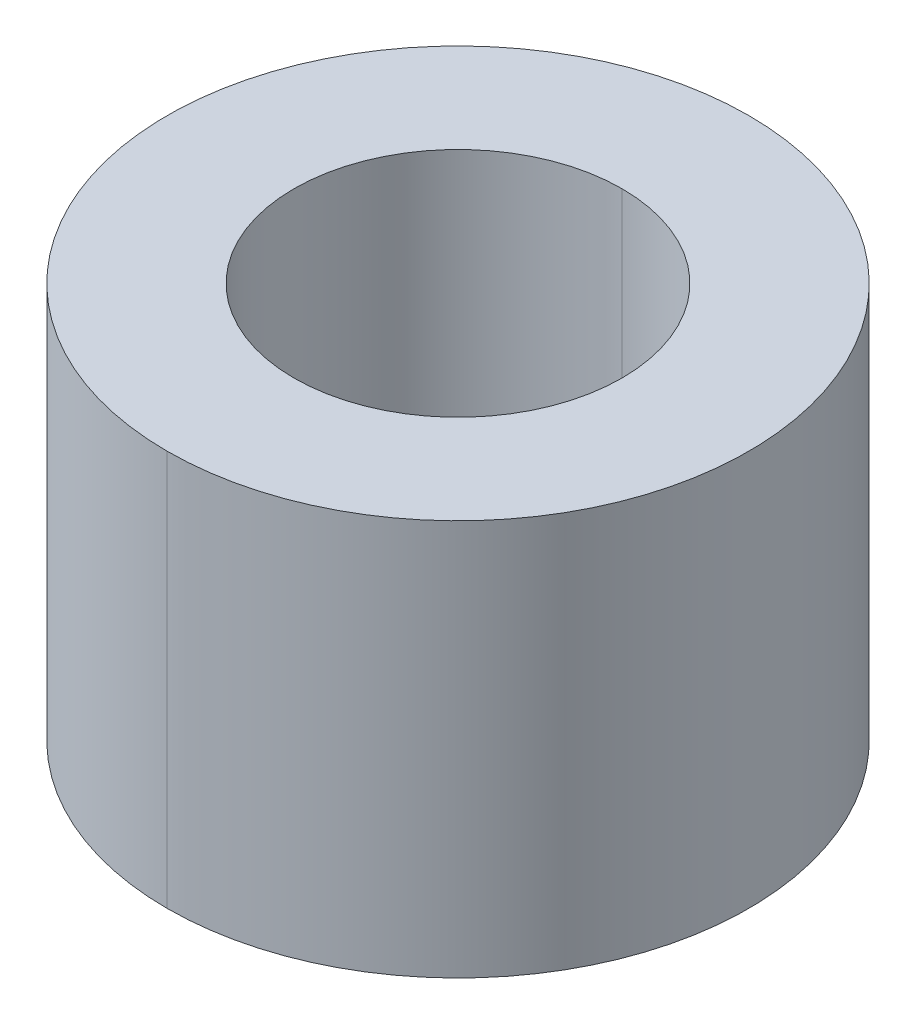
ISO-10303-21;
HEADER;
FILE_DESCRIPTION(('STEP AP214'),'2;1');
FILE_NAME('part.step','',(''),(''),'','','');
FILE_SCHEMA(('AUTOMOTIVE_DESIGN { 1 0 10303 214 1 1 1 1 }'));
ENDSEC;
DATA;
#1=APPLICATION_CONTEXT('core data for automotive mechanical design processes');
#2=APPLICATION_PROTOCOL_DEFINITION('international standard','automotive_design',2000,#1);
#3=PRODUCT_CONTEXT('',#1,'mechanical');
#4=PRODUCT('Part','Part','',(#3));
#5=PRODUCT_RELATED_PRODUCT_CATEGORY('part','',(#4));
#6=PRODUCT_DEFINITION_FORMATION('','',#4);
#7=PRODUCT_DEFINITION_CONTEXT('part definition',#1,'design');
#8=PRODUCT_DEFINITION('design','',#6,#7);
#9=PRODUCT_DEFINITION_SHAPE('','',#8);
#10=(LENGTH_UNIT() NAMED_UNIT(*) SI_UNIT(.MILLI.,.METRE.));
#11=(NAMED_UNIT(*) PLANE_ANGLE_UNIT() SI_UNIT($,.RADIAN.));
#12=(NAMED_UNIT(*) SI_UNIT($,.STERADIAN.) SOLID_ANGLE_UNIT());
#13=UNCERTAINTY_MEASURE_WITH_UNIT(LENGTH_MEASURE(1.E-05),#10,'distance_accuracy_value','');
#14=(GEOMETRIC_REPRESENTATION_CONTEXT(3) GLOBAL_UNCERTAINTY_ASSIGNED_CONTEXT((#13)) GLOBAL_UNIT_ASSIGNED_CONTEXT((#10,
#11,#12)) REPRESENTATION_CONTEXT('',''));
#15=CARTESIAN_POINT('',(0.,0.,0.));
#16=DIRECTION('',(0.,0.,1.));
#17=DIRECTION('',(1.,0.,0.));
#18=AXIS2_PLACEMENT_3D('',#15,#16,#17);
#19=CARTESIAN_POINT('',(0.,30.3,4.44089209850063E-13));
#20=DIRECTION('',(0.,-1.,0.));
#21=DIRECTION('',(0.,0.,-1.));
#22=AXIS2_PLACEMENT_3D('',#19,#20,#21);
#23=CYLINDRICAL_SURFACE('',#22,12.5500000000003);
#24=DIRECTION('',(0.,-1.,0.));
#25=VECTOR('',#24,1.);
#26=CARTESIAN_POINT('',(0.,30.3,12.5500000000008));
#27=LINE('',#26,#25);
#28=CARTESIAN_POINT('',(0.,30.3,12.5500000000004));
#29=VERTEX_POINT('',#28);
#30=CARTESIAN_POINT('',(0.,0.,12.55));
#31=VERTEX_POINT('',#30);
#32=EDGE_CURVE('E91',#29,#31,#27,.T.);
#33=ORIENTED_EDGE('',*,*,#32,.F.);
#34=CARTESIAN_POINT('',(0.,30.3,4.44089209850063E-13));
#35=DIRECTION('',(0.,1.,0.));
#36=DIRECTION('',(0.,0.,1.));
#37=AXIS2_PLACEMENT_3D('',#34,#35,#36);
#38=CIRCLE('',#37,12.5500000000003);
#39=CARTESIAN_POINT('',(0.,30.3,-12.5499999999995));
#40=VERTEX_POINT('',#39);
#41=EDGE_CURVE('E82',#29,#40,#38,.T.);
#42=ORIENTED_EDGE('',*,*,#41,.T.);
#43=DIRECTION('',(0.,-1.,0.));
#44=VECTOR('',#43,1.);
#45=CARTESIAN_POINT('',(0.,30.3,-12.5499999999999));
#46=LINE('',#45,#44);
#47=CARTESIAN_POINT('',(0.,0.,-12.55));
#48=VERTEX_POINT('',#47);
#49=EDGE_CURVE('E88',#40,#48,#46,.T.);
#50=ORIENTED_EDGE('',*,*,#49,.T.);
#51=CARTESIAN_POINT('',(0.,0.,0.));
#52=DIRECTION('',(0.,1.,0.));
#53=DIRECTION('',(0.,0.,1.));
#54=AXIS2_PLACEMENT_3D('',#51,#52,#53);
#55=CIRCLE('',#54,12.5500000000003);
#56=EDGE_CURVE('E11',#31,#48,#55,.T.);
#57=ORIENTED_EDGE('',*,*,#56,.F.);
#58=EDGE_LOOP('',(#33,#42,#50,#57));
#59=FACE_BOUND('',#58,.T.);
#60=ADVANCED_FACE('F17',(#59),#23,.F.);
#61=CARTESIAN_POINT('',(0.,30.3,4.44089209850063E-13));
#62=DIRECTION('',(0.,-1.,0.));
#63=DIRECTION('',(0.,0.,-1.));
#64=AXIS2_PLACEMENT_3D('',#61,#62,#63);
#65=CYLINDRICAL_SURFACE('',#64,22.2500000000006);
#66=DIRECTION('',(0.,-1.,0.));
#67=VECTOR('',#66,1.);
#68=CARTESIAN_POINT('',(0.,30.3,22.250000000001));
#69=LINE('',#68,#67);
#70=CARTESIAN_POINT('',(0.,30.3,22.2500000000005));
#71=VERTEX_POINT('',#70);
#72=CARTESIAN_POINT('',(0.,0.,22.25));
#73=VERTEX_POINT('',#72);
#74=EDGE_CURVE('E115',#71,#73,#69,.T.);
#75=ORIENTED_EDGE('',*,*,#74,.F.);
#76=CARTESIAN_POINT('',(0.,30.3,4.44089209850063E-13));
#77=DIRECTION('',(0.,1.,0.));
#78=DIRECTION('',(0.,0.,1.));
#79=AXIS2_PLACEMENT_3D('',#76,#77,#78);
#80=CIRCLE('',#79,22.2500000000006);
#81=CARTESIAN_POINT('',(0.,30.3,-22.2499999999996));
#82=VERTEX_POINT('',#81);
#83=EDGE_CURVE('E21',#82,#71,#80,.T.);
#84=ORIENTED_EDGE('',*,*,#83,.F.);
#85=DIRECTION('',(0.,-1.,0.));
#86=VECTOR('',#85,1.);
#87=CARTESIAN_POINT('',(0.,30.3,-22.25));
#88=LINE('',#87,#86);
#89=CARTESIAN_POINT('',(0.,0.,-22.25));
#90=VERTEX_POINT('',#89);
#91=EDGE_CURVE('E114',#82,#90,#88,.T.);
#92=ORIENTED_EDGE('',*,*,#91,.T.);
#93=CARTESIAN_POINT('',(0.,0.,0.));
#94=DIRECTION('',(0.,1.,0.));
#95=DIRECTION('',(0.,0.,1.));
#96=AXIS2_PLACEMENT_3D('',#93,#94,#95);
#97=CIRCLE('',#96,22.2500000000006);
#98=EDGE_CURVE('E27',#90,#73,#97,.T.);
#99=ORIENTED_EDGE('',*,*,#98,.T.);
#100=EDGE_LOOP('',(#75,#84,#92,#99));
#101=FACE_BOUND('',#100,.T.);
#102=ADVANCED_FACE('F129',(#101),#65,.T.);
#103=CARTESIAN_POINT('',(0.,0.,0.));
#104=DIRECTION('',(0.,1.,0.));
#105=DIRECTION('',(0.,0.,-1.));
#106=AXIS2_PLACEMENT_3D('',#103,#104,#105);
#107=PLANE('',#106);
#108=CARTESIAN_POINT('',(0.,0.,0.));
#109=DIRECTION('',(0.,1.,0.));
#110=DIRECTION('',(0.,0.,1.));
#111=AXIS2_PLACEMENT_3D('',#108,#109,#110);
#112=CIRCLE('',#111,12.5500000000003);
#113=EDGE_CURVE('E98',#48,#31,#112,.T.);
#114=ORIENTED_EDGE('',*,*,#113,.T.);
#115=ORIENTED_EDGE('',*,*,#56,.T.);
#116=EDGE_LOOP('',(#114,#115));
#117=FACE_BOUND('',#116,.T.);
#118=ORIENTED_EDGE('',*,*,#98,.F.);
#119=CARTESIAN_POINT('',(0.,0.,0.));
#120=DIRECTION('',(0.,1.,0.));
#121=DIRECTION('',(0.,0.,1.));
#122=AXIS2_PLACEMENT_3D('',#119,#120,#121);
#123=CIRCLE('',#122,22.2500000000006);
#124=EDGE_CURVE('E112',#73,#90,#123,.T.);
#125=ORIENTED_EDGE('',*,*,#124,.F.);
#126=EDGE_LOOP('',(#118,#125));
#127=FACE_BOUND('',#126,.T.);
#128=ADVANCED_FACE('F127',(#117,#127),#107,.F.);
#129=CARTESIAN_POINT('',(0.,30.3,4.44089209850063E-13));
#130=DIRECTION('',(0.,1.,0.));
#131=DIRECTION('',(0.,0.,-1.));
#132=AXIS2_PLACEMENT_3D('',#129,#130,#131);
#133=PLANE('',#132);
#134=CARTESIAN_POINT('',(0.,30.3,4.44089209850063E-13));
#135=DIRECTION('',(0.,1.,0.));
#136=DIRECTION('',(0.,0.,1.));
#137=AXIS2_PLACEMENT_3D('',#134,#135,#136);
#138=CIRCLE('',#137,12.5500000000003);
#139=EDGE_CURVE('E97',#40,#29,#138,.T.);
#140=ORIENTED_EDGE('',*,*,#139,.F.);
#141=ORIENTED_EDGE('',*,*,#41,.F.);
#142=EDGE_LOOP('',(#140,#141));
#143=FACE_BOUND('',#142,.T.);
#144=ORIENTED_EDGE('',*,*,#83,.T.);
#145=CARTESIAN_POINT('',(0.,30.3,4.44089209850063E-13));
#146=DIRECTION('',(0.,1.,0.));
#147=DIRECTION('',(0.,0.,1.));
#148=AXIS2_PLACEMENT_3D('',#145,#146,#147);
#149=CIRCLE('',#148,22.2500000000006);
#150=EDGE_CURVE('E100',#71,#82,#149,.T.);
#151=ORIENTED_EDGE('',*,*,#150,.T.);
#152=EDGE_LOOP('',(#144,#151));
#153=FACE_BOUND('',#152,.T.);
#154=ADVANCED_FACE('F19',(#143,#153),#133,.T.);
#155=CARTESIAN_POINT('',(0.,30.3,4.44089209850063E-13));
#156=DIRECTION('',(0.,-1.,0.));
#157=DIRECTION('',(0.,0.,-1.));
#158=AXIS2_PLACEMENT_3D('',#155,#156,#157);
#159=CYLINDRICAL_SURFACE('',#158,22.2500000000006);
#160=ORIENTED_EDGE('',*,*,#150,.F.);
#161=ORIENTED_EDGE('',*,*,#74,.T.);
#162=ORIENTED_EDGE('',*,*,#124,.T.);
#163=ORIENTED_EDGE('',*,*,#91,.F.);
#164=EDGE_LOOP('',(#160,#161,#162,#163));
#165=FACE_BOUND('',#164,.T.);
#166=ADVANCED_FACE('F136',(#165),#159,.T.);
#167=CARTESIAN_POINT('',(0.,30.3,4.44089209850063E-13));
#168=DIRECTION('',(0.,-1.,0.));
#169=DIRECTION('',(0.,0.,-1.));
#170=AXIS2_PLACEMENT_3D('',#167,#168,#169);
#171=CYLINDRICAL_SURFACE('',#170,12.5500000000003);
#172=ORIENTED_EDGE('',*,*,#139,.T.);
#173=ORIENTED_EDGE('',*,*,#32,.T.);
#174=ORIENTED_EDGE('',*,*,#113,.F.);
#175=ORIENTED_EDGE('',*,*,#49,.F.);
#176=EDGE_LOOP('',(#172,#173,#174,#175));
#177=FACE_BOUND('',#176,.T.);
#178=ADVANCED_FACE('F96',(#177),#171,.F.);
#179=CLOSED_SHELL('',(#60,#102,#128,#154,#166,#178));
#180=MANIFOLD_SOLID_BREP('B1',#179);
#181=ADVANCED_BREP_SHAPE_REPRESENTATION('',(#18,#180),#14);
#182=SHAPE_DEFINITION_REPRESENTATION(#9,#181);
ENDSEC;
END-ISO-10303-21;
